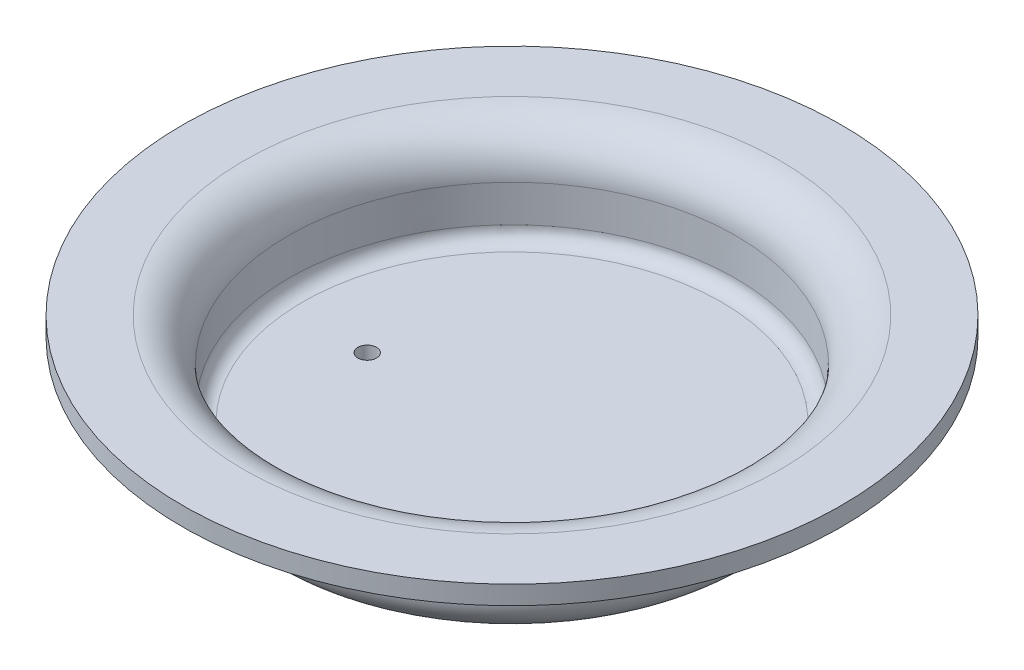
ISO-10303-21;
HEADER;
FILE_DESCRIPTION(('STEP AP214'),'2;1');
FILE_NAME('part.step','',(''),(''),'','','');
FILE_SCHEMA(('AUTOMOTIVE_DESIGN { 1 0 10303 214 1 1 1 1 }'));
ENDSEC;
DATA;
#1=APPLICATION_CONTEXT('core data for automotive mechanical design processes');
#2=APPLICATION_PROTOCOL_DEFINITION('international standard','automotive_design',2000,#1);
#3=PRODUCT_CONTEXT('',#1,'mechanical');
#4=PRODUCT('Part','Part','',(#3));
#5=PRODUCT_RELATED_PRODUCT_CATEGORY('part','',(#4));
#6=PRODUCT_DEFINITION_FORMATION('','',#4);
#7=PRODUCT_DEFINITION_CONTEXT('part definition',#1,'design');
#8=PRODUCT_DEFINITION('design','',#6,#7);
#9=PRODUCT_DEFINITION_SHAPE('','',#8);
#10=(LENGTH_UNIT() NAMED_UNIT(*) SI_UNIT(.MILLI.,.METRE.));
#11=(NAMED_UNIT(*) PLANE_ANGLE_UNIT() SI_UNIT($,.RADIAN.));
#12=(NAMED_UNIT(*) SI_UNIT($,.STERADIAN.) SOLID_ANGLE_UNIT());
#13=UNCERTAINTY_MEASURE_WITH_UNIT(LENGTH_MEASURE(1.E-05),#10,'distance_accuracy_value','');
#14=(GEOMETRIC_REPRESENTATION_CONTEXT(3) GLOBAL_UNCERTAINTY_ASSIGNED_CONTEXT((#13)) GLOBAL_UNIT_ASSIGNED_CONTEXT((#10,
#11,#12)) REPRESENTATION_CONTEXT('',''));
#15=CARTESIAN_POINT('',(0.,0.,0.));
#16=DIRECTION('',(0.,0.,1.));
#17=DIRECTION('',(1.,0.,0.));
#18=AXIS2_PLACEMENT_3D('',#15,#16,#17);
#19=CARTESIAN_POINT('',(-57.9721216068135,297.912651075744,-63.3116237988176));
#20=DIRECTION('',(0.,1.,0.));
#21=DIRECTION('',(-0.0870499432920004,0.,-0.996203948683632));
#22=AXIS2_PLACEMENT_3D('',#19,#20,#21);
#23=PLANE('',#22);
#24=CARTESIAN_POINT('',(-41.1984171468201,297.912651075744,-64.7773377462162));
#25=DIRECTION('',(0.,-1.,0.));
#26=DIRECTION('',(-0.0870499432920003,0.,-0.996203948683632));
#27=AXIS2_PLACEMENT_3D('',#24,#25,#26);
#28=CIRCLE('',#27,16.837620933101);
#29=CARTESIAN_POINT('',(-42.6641310942187,297.912651075744,-81.5510422062096));
#30=VERTEX_POINT('',#29);
#31=EDGE_CURVE('E35',#30,#30,#28,.T.);
#32=ORIENTED_EDGE('',*,*,#31,.F.);
#33=EDGE_LOOP('',(#32));
#34=FACE_BOUND('',#33,.T.);
#35=CARTESIAN_POINT('',(-51.9076095951691,297.912651075744,-63.8415508558272));
#36=DIRECTION('',(0.,-1.,0.));
#37=DIRECTION('',(0.0870499432919964,0.,0.996203948683632));
#38=AXIS2_PLACEMENT_3D('',#35,#36,#37);
#39=CIRCLE('',#38,0.75);
#40=CARTESIAN_POINT('',(-51.8423221377001,297.912651075744,-63.0943978943145));
#41=VERTEX_POINT('',#40);
#42=EDGE_CURVE('E11',#41,#41,#39,.T.);
#43=ORIENTED_EDGE('',*,*,#42,.T.);
#44=EDGE_LOOP('',(#43));
#45=FACE_BOUND('',#44,.T.);
#46=ADVANCED_FACE('F17',(#34,#45),#23,.T.);
#47=CARTESIAN_POINT('',(-41.1984171468201,296.412651075744,-64.7773377462162));
#48=DIRECTION('',(0.,-1.,0.));
#49=DIRECTION('',(0.0870499432920004,0.,0.996203948683632));
#50=AXIS2_PLACEMENT_3D('',#47,#48,#49);
#51=PLANE('',#50);
#52=CARTESIAN_POINT('',(-41.1984171468201,296.412651075744,-64.7773377462162));
#53=DIRECTION('',(0.,-1.,0.));
#54=DIRECTION('',(-0.0870499432920003,0.,-0.996203948683632));
#55=AXIS2_PLACEMENT_3D('',#52,#53,#54);
#56=CIRCLE('',#55,16.837620933101);
#57=CARTESIAN_POINT('',(-42.6641310942187,296.412651075744,-81.5510422062096));
#58=VERTEX_POINT('',#57);
#59=EDGE_CURVE('E28',#58,#58,#56,.T.);
#60=ORIENTED_EDGE('',*,*,#59,.T.);
#61=EDGE_LOOP('',(#60));
#62=FACE_BOUND('',#61,.T.);
#63=CARTESIAN_POINT('',(-51.9076095951691,296.412651075744,-63.8415508558272));
#64=DIRECTION('',(0.,1.,0.));
#65=DIRECTION('',(-0.0870499432919964,0.,-0.996203948683632));
#66=AXIS2_PLACEMENT_3D('',#63,#64,#65);
#67=CIRCLE('',#66,0.75);
#68=CARTESIAN_POINT('',(-51.9728970526381,296.412651075744,-64.5887038173399));
#69=VERTEX_POINT('',#68);
#70=EDGE_CURVE('E154',#69,#69,#67,.T.);
#71=ORIENTED_EDGE('',*,*,#70,.T.);
#72=EDGE_LOOP('',(#71));
#73=FACE_BOUND('',#72,.T.);
#74=ADVANCED_FACE('F121',(#62,#73),#51,.T.);
#75=CARTESIAN_POINT('',(-41.1984171468201,301.877126269512,-64.7773377462162));
#76=DIRECTION('',(0.,-1.,0.));
#77=DIRECTION('',(0.0870499432920004,0.,0.996203948683632));
#78=AXIS2_PLACEMENT_3D('',#75,#76,#77);
#79=TOROIDAL_SURFACE('',#78,21.5438661543864,3.53552480623152);
#80=CARTESIAN_POINT('',(-41.1984171468201,301.9388296854,-64.7773377462162));
#81=DIRECTION('',(0.,-1.,0.));
#82=DIRECTION('',(-0.0870499432920005,0.,-0.996203948683632));
#83=AXIS2_PLACEMENT_3D('',#80,#81,#82);
#84=CIRCLE('',#83,18.0088798257075);
#85=CARTESIAN_POINT('',(-42.7660891144004,301.9388296854,-82.717854939955));
#86=VERTEX_POINT('',#85);
#87=EDGE_CURVE('E86',#86,#86,#84,.T.);
#88=ORIENTED_EDGE('',*,*,#87,.T.);
#89=EDGE_LOOP('',(#88));
#90=FACE_BOUND('',#89,.T.);
#91=CARTESIAN_POINT('',(-41.1984171468201,305.412651075744,-64.7773377462162));
#92=DIRECTION('',(0.,-1.,0.));
#93=DIRECTION('',(-0.0870499432920003,0.,-0.996203948683632));
#94=AXIS2_PLACEMENT_3D('',#91,#92,#93);
#95=CIRCLE('',#94,21.5438661543864);
#96=CARTESIAN_POINT('',(-43.0738094738499,305.412651075744,-86.2394222791276));
#97=VERTEX_POINT('',#96);
#98=EDGE_CURVE('E73',#97,#97,#95,.T.);
#99=ORIENTED_EDGE('',*,*,#98,.F.);
#100=EDGE_LOOP('',(#99));
#101=FACE_BOUND('',#100,.T.);
#102=ADVANCED_FACE('F126',(#90,#101),#79,.T.);
#103=CARTESIAN_POINT('',(-41.1984171468201,301.9388296854,-64.7773377462162));
#104=DIRECTION('',(0.,1.,0.));
#105=DIRECTION('',(-0.0870499432920004,0.,-0.996203948683632));
#106=AXIS2_PLACEMENT_3D('',#103,#104,#105);
#107=CONICAL_SURFACE('',#106,18.0088798257075,0.0174532925199424);
#108=CARTESIAN_POINT('',(-41.1984171468201,299.013465074463,-64.7773377462162));
#109=DIRECTION('',(0.,-1.,0.));
#110=DIRECTION('',(-0.0870499432920004,0.,-0.996203948683632));
#111=AXIS2_PLACEMENT_3D('',#108,#109,#110);
#112=CIRCLE('',#111,17.9578173964849);
#113=CARTESIAN_POINT('',(-42.7616441328322,299.013465074463,-82.6669863463341));
#114=VERTEX_POINT('',#113);
#115=EDGE_CURVE('E88',#114,#114,#112,.T.);
#116=ORIENTED_EDGE('',*,*,#115,.T.);
#117=EDGE_LOOP('',(#116));
#118=FACE_BOUND('',#117,.T.);
#119=ORIENTED_EDGE('',*,*,#87,.F.);
#120=EDGE_LOOP('',(#119));
#121=FACE_BOUND('',#120,.T.);
#122=ADVANCED_FACE('F133',(#118,#121),#107,.F.);
#123=CARTESIAN_POINT('',(-41.1984171468201,299.033018176464,-64.7773377462162));
#124=DIRECTION('',(0.,-1.,0.));
#125=DIRECTION('',(0.0870499432920005,0.,0.996203948683632));
#126=AXIS2_PLACEMENT_3D('',#123,#124,#125);
#127=TOROIDAL_SURFACE('',#126,16.837620933101,1.12036710072);
#128=ORIENTED_EDGE('',*,*,#31,.T.);
#129=EDGE_LOOP('',(#128));
#130=FACE_BOUND('',#129,.T.);
#131=ORIENTED_EDGE('',*,*,#115,.F.);
#132=EDGE_LOOP('',(#131));
#133=FACE_BOUND('',#132,.T.);
#134=ADVANCED_FACE('F137',(#130,#133),#127,.F.);
#135=CARTESIAN_POINT('',(-41.1984171468201,299.033018176464,-64.7773377462162));
#136=DIRECTION('',(0.,-1.,0.));
#137=DIRECTION('',(0.0870499432920006,0.,0.996203948683632));
#138=AXIS2_PLACEMENT_3D('',#135,#136,#137);
#139=TOROIDAL_SURFACE('',#138,16.837620933101,2.62036710072);
#140=CARTESIAN_POINT('',(-41.1984171468201,298.987286464807,-64.7773377462162));
#141=DIRECTION('',(0.,-1.,0.));
#142=DIRECTION('',(-0.0870499432920005,0.,-0.996203948683632));
#143=AXIS2_PLACEMENT_3D('',#140,#141,#142);
#144=CIRCLE('',#143,19.4575889392195);
#145=CARTESIAN_POINT('',(-42.8921991605782,298.987286464807,-84.1610646793297));
#146=VERTEX_POINT('',#145);
#147=EDGE_CURVE('E92',#146,#146,#144,.T.);
#148=ORIENTED_EDGE('',*,*,#147,.T.);
#149=EDGE_LOOP('',(#148));
#150=FACE_BOUND('',#149,.T.);
#151=ORIENTED_EDGE('',*,*,#59,.F.);
#152=EDGE_LOOP('',(#151));
#153=FACE_BOUND('',#152,.T.);
#154=ADVANCED_FACE('F141',(#150,#153),#139,.T.);
#155=CARTESIAN_POINT('',(-41.1984171468201,298.987286464807,-64.7773377462162));
#156=DIRECTION('',(0.,1.,0.));
#157=DIRECTION('',(-0.0870499432920004,0.,-0.996203948683632));
#158=AXIS2_PLACEMENT_3D('',#155,#156,#157);
#159=CONICAL_SURFACE('',#158,19.4575889392195,0.0174532925199424);
#160=CARTESIAN_POINT('',(-41.1984171468201,301.912651075744,-64.7773377462162));
#161=DIRECTION('',(0.,-1.,0.));
#162=DIRECTION('',(-0.0870499432920005,0.,-0.996203948683632));
#163=AXIS2_PLACEMENT_3D('',#160,#161,#162);
#164=CIRCLE('',#163,19.5086513684422);
#165=CARTESIAN_POINT('',(-42.8966441421464,301.912651075744,-84.2119332729506));
#166=VERTEX_POINT('',#165);
#167=EDGE_CURVE('E96',#166,#166,#164,.T.);
#168=ORIENTED_EDGE('',*,*,#167,.T.);
#169=EDGE_LOOP('',(#168));
#170=FACE_BOUND('',#169,.T.);
#171=ORIENTED_EDGE('',*,*,#147,.F.);
#172=EDGE_LOOP('',(#171));
#173=FACE_BOUND('',#172,.T.);
#174=ADVANCED_FACE('F118',(#170,#173),#159,.T.);
#175=CARTESIAN_POINT('',(-41.1984171468201,301.877126269512,-64.7773377462162));
#176=DIRECTION('',(0.,-1.,0.));
#177=DIRECTION('',(0.0870499432920003,0.,0.996203948683632));
#178=AXIS2_PLACEMENT_3D('',#175,#176,#177);
#179=TOROIDAL_SURFACE('',#178,21.5438661543864,2.03552480623152);
#180=CARTESIAN_POINT('',(-41.1984171468201,303.912651075744,-64.7773377462162));
#181=DIRECTION('',(0.,-1.,0.));
#182=DIRECTION('',(-0.0870499432920005,0.,-0.996203948683632));
#183=AXIS2_PLACEMENT_3D('',#180,#181,#182);
#184=CIRCLE('',#183,21.5438661543818);
#185=CARTESIAN_POINT('',(-43.0738094738495,303.912651075744,-86.2394222791229));
#186=VERTEX_POINT('',#185);
#187=EDGE_CURVE('E78',#186,#186,#184,.T.);
#188=ORIENTED_EDGE('',*,*,#187,.T.);
#189=EDGE_LOOP('',(#188));
#190=FACE_BOUND('',#189,.T.);
#191=ORIENTED_EDGE('',*,*,#167,.F.);
#192=EDGE_LOOP('',(#191));
#193=FACE_BOUND('',#192,.T.);
#194=ADVANCED_FACE('F104',(#190,#193),#179,.F.);
#195=CARTESIAN_POINT('',(-62.6605016797315,303.912651075744,-62.9019454191864));
#196=DIRECTION('',(0.,-1.,0.));
#197=DIRECTION('',(0.0870499432920004,0.,0.996203948683632));
#198=AXIS2_PLACEMENT_3D('',#195,#196,#197);
#199=PLANE('',#198);
#200=CARTESIAN_POINT('',(-41.1984171468201,303.912651075744,-64.7773377462162));
#201=DIRECTION('',(0.,-1.,0.));
#202=DIRECTION('',(-0.0870499432920003,0.,-0.996203948683632));
#203=AXIS2_PLACEMENT_3D('',#200,#201,#202);
#204=CIRCLE('',#203,26.5);
#205=CARTESIAN_POINT('',(-43.5052406440581,303.912651075744,-91.1767423863324));
#206=VERTEX_POINT('',#205);
#207=EDGE_CURVE('E66',#206,#206,#204,.T.);
#208=ORIENTED_EDGE('',*,*,#207,.T.);
#209=EDGE_LOOP('',(#208));
#210=FACE_BOUND('',#209,.T.);
#211=ORIENTED_EDGE('',*,*,#187,.F.);
#212=EDGE_LOOP('',(#211));
#213=FACE_BOUND('',#212,.T.);
#214=ADVANCED_FACE('F107',(#210,#213),#199,.T.);
#215=CARTESIAN_POINT('',(-41.1984171468201,297.912651075744,-64.7773377462162));
#216=DIRECTION('',(0.,-1.,0.));
#217=DIRECTION('',(0.0870499432920003,0.,0.996203948683632));
#218=AXIS2_PLACEMENT_3D('',#215,#216,#217);
#219=CYLINDRICAL_SURFACE('',#218,26.5);
#220=CARTESIAN_POINT('',(-41.1984171468201,305.412651075744,-64.7773377462162));
#221=DIRECTION('',(0.,-1.,0.));
#222=DIRECTION('',(-0.0870499432920003,0.,-0.996203948683632));
#223=AXIS2_PLACEMENT_3D('',#220,#221,#222);
#224=CIRCLE('',#223,26.5);
#225=CARTESIAN_POINT('',(-43.5052406440581,305.412651075744,-91.1767423863324));
#226=VERTEX_POINT('',#225);
#227=EDGE_CURVE('E21',#226,#226,#224,.T.);
#228=ORIENTED_EDGE('',*,*,#227,.T.);
#229=EDGE_LOOP('',(#228));
#230=FACE_BOUND('',#229,.T.);
#231=ORIENTED_EDGE('',*,*,#207,.F.);
#232=EDGE_LOOP('',(#231));
#233=FACE_BOUND('',#232,.T.);
#234=ADVANCED_FACE('F109',(#230,#233),#219,.T.);
#235=CARTESIAN_POINT('',(-67.5978217869363,305.412651075744,-62.4705142489782));
#236=DIRECTION('',(0.,1.,0.));
#237=DIRECTION('',(-0.0870499432920004,0.,-0.996203948683632));
#238=AXIS2_PLACEMENT_3D('',#235,#236,#237);
#239=PLANE('',#238);
#240=ORIENTED_EDGE('',*,*,#98,.T.);
#241=EDGE_LOOP('',(#240));
#242=FACE_BOUND('',#241,.T.);
#243=ORIENTED_EDGE('',*,*,#227,.F.);
#244=EDGE_LOOP('',(#243));
#245=FACE_BOUND('',#244,.T.);
#246=ADVANCED_FACE('F70',(#242,#245),#239,.T.);
#247=CARTESIAN_POINT('',(-51.9076095951691,347.912651075744,-63.8415508558272));
#248=DIRECTION('',(0.,-1.,0.));
#249=DIRECTION('',(0.0870499432919964,0.,0.996203948683632));
#250=AXIS2_PLACEMENT_3D('',#247,#248,#249);
#251=CYLINDRICAL_SURFACE('',#250,0.75);
#252=ORIENTED_EDGE('',*,*,#42,.F.);
#253=EDGE_LOOP('',(#252));
#254=FACE_BOUND('',#253,.T.);
#255=ORIENTED_EDGE('',*,*,#70,.F.);
#256=EDGE_LOOP('',(#255));
#257=FACE_BOUND('',#256,.T.);
#258=ADVANCED_FACE('F19',(#254,#257),#251,.F.);
#259=CLOSED_SHELL('',(#46,#74,#102,#122,#134,#154,#174,#194,#214,#234,#246,#258));
#260=MANIFOLD_SOLID_BREP('B1',#259);
#261=ADVANCED_BREP_SHAPE_REPRESENTATION('',(#18,#260),#14);
#262=SHAPE_DEFINITION_REPRESENTATION(#9,#261);
ENDSEC;
END-ISO-10303-21;
